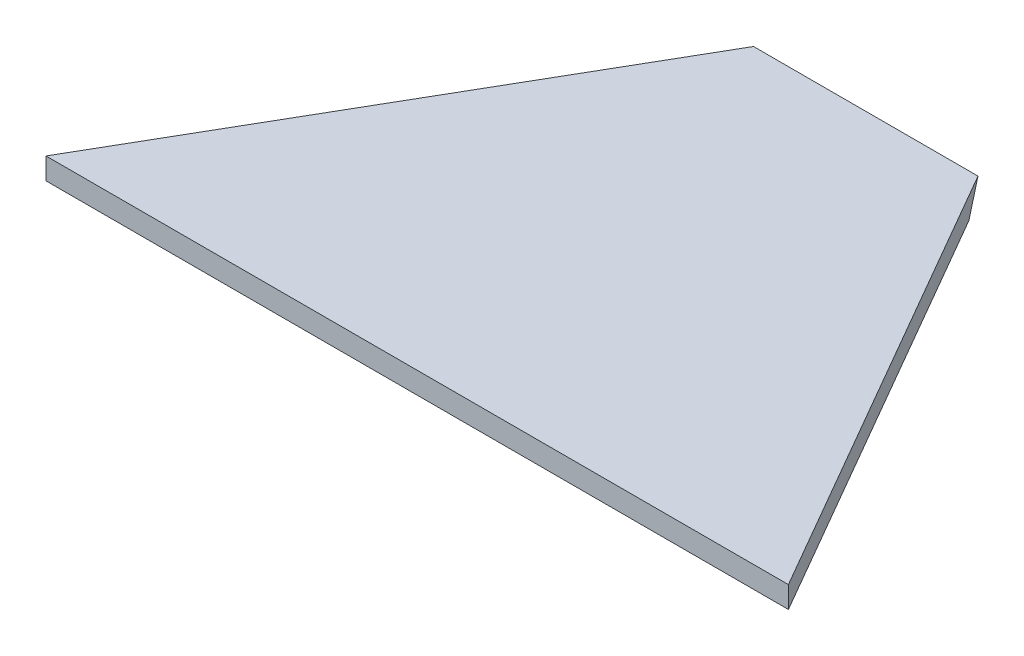
ISO-10303-21;
HEADER;
FILE_DESCRIPTION(('STEP AP214'),'2;1');
FILE_NAME('part.step','',(''),(''),'','','');
FILE_SCHEMA(('AUTOMOTIVE_DESIGN { 1 0 10303 214 1 1 1 1 }'));
ENDSEC;
DATA;
#1=APPLICATION_CONTEXT('core data for automotive mechanical design processes');
#2=APPLICATION_PROTOCOL_DEFINITION('international standard','automotive_design',2000,#1);
#3=PRODUCT_CONTEXT('',#1,'mechanical');
#4=PRODUCT('Part','Part','',(#3));
#5=PRODUCT_RELATED_PRODUCT_CATEGORY('part','',(#4));
#6=PRODUCT_DEFINITION_FORMATION('','',#4);
#7=PRODUCT_DEFINITION_CONTEXT('part definition',#1,'design');
#8=PRODUCT_DEFINITION('design','',#6,#7);
#9=PRODUCT_DEFINITION_SHAPE('','',#8);
#10=(LENGTH_UNIT() NAMED_UNIT(*) SI_UNIT(.MILLI.,.METRE.));
#11=(NAMED_UNIT(*) PLANE_ANGLE_UNIT() SI_UNIT($,.RADIAN.));
#12=(NAMED_UNIT(*) SI_UNIT($,.STERADIAN.) SOLID_ANGLE_UNIT());
#13=UNCERTAINTY_MEASURE_WITH_UNIT(LENGTH_MEASURE(1.E-05),#10,'distance_accuracy_value','');
#14=(GEOMETRIC_REPRESENTATION_CONTEXT(3) GLOBAL_UNCERTAINTY_ASSIGNED_CONTEXT((#13)) GLOBAL_UNIT_ASSIGNED_CONTEXT((#10,
#11,#12)) REPRESENTATION_CONTEXT('',''));
#15=CARTESIAN_POINT('',(0.,0.,0.));
#16=DIRECTION('',(0.,0.,1.));
#17=DIRECTION('',(1.,0.,0.));
#18=AXIS2_PLACEMENT_3D('',#15,#16,#17);
#19=CARTESIAN_POINT('',(-109.22,6.35,85.0861411019661));
#20=DIRECTION('',(-0.86602540378444,0.,-0.499999999999998));
#21=DIRECTION('',(-0.499999999999998,0.,0.86602540378444));
#22=AXIS2_PLACEMENT_3D('',#19,#20,#21);
#23=PLANE('',#22);
#24=DIRECTION('',(0.499999999999998,0.,-0.86602540378444));
#25=VECTOR('',#24,1.);
#26=CARTESIAN_POINT('',(-109.22,6.35,85.0861411019661));
#27=LINE('',#26,#25);
#28=CARTESIAN_POINT('',(-109.22,6.35,85.0861411019661));
#29=VERTEX_POINT('',#28);
#30=CARTESIAN_POINT('',(-33.02,6.35,-46.8961304347825));
#31=VERTEX_POINT('',#30);
#32=EDGE_CURVE('E94',#29,#31,#27,.T.);
#33=ORIENTED_EDGE('',*,*,#32,.T.);
#34=DIRECTION('',(-0.377964473009227,-0.654653670707973,0.654653670707981));
#35=VECTOR('',#34,1.);
#36=CARTESIAN_POINT('',(-43.9058571428571,-12.504857655365,-28.0412727794173));
#37=LINE('',#36,#35);
#38=CARTESIAN_POINT('',(-36.6861742093541,0.,-40.5461304347825));
#39=VERTEX_POINT('',#38);
#40=EDGE_CURVE('E98',#31,#39,#37,.T.);
#41=ORIENTED_EDGE('',*,*,#40,.T.);
#42=DIRECTION('',(0.499999999999998,0.,-0.86602540378444));
#43=VECTOR('',#42,1.);
#44=CARTESIAN_POINT('',(-109.22,0.,85.0861411019661));
#45=LINE('',#44,#43);
#46=CARTESIAN_POINT('',(-109.22,0.,85.0861411019661));
#47=VERTEX_POINT('',#46);
#48=EDGE_CURVE('E90',#47,#39,#45,.T.);
#49=ORIENTED_EDGE('',*,*,#48,.F.);
#50=DIRECTION('',(0.,-1.,0.));
#51=VECTOR('',#50,1.);
#52=CARTESIAN_POINT('',(-109.22,6.35,85.0861411019661));
#53=LINE('',#52,#51);
#54=EDGE_CURVE('E11',#29,#47,#53,.T.);
#55=ORIENTED_EDGE('',*,*,#54,.F.);
#56=EDGE_LOOP('',(#33,#41,#49,#55));
#57=FACE_BOUND('',#56,.T.);
#58=ADVANCED_FACE('F45',(#57),#23,.T.);
#59=CARTESIAN_POINT('',(109.22,6.35,85.0861411019661));
#60=DIRECTION('',(-0.86602540378444,0.,0.499999999999998));
#61=DIRECTION('',(0.499999999999998,0.,0.86602540378444));
#62=AXIS2_PLACEMENT_3D('',#59,#60,#61);
#63=PLANE('',#62);
#64=DIRECTION('',(-0.377964473009227,0.654653670707973,-0.654653670707981));
#65=VECTOR('',#64,1.);
#66=CARTESIAN_POINT('',(43.9058571428571,-12.5048576553649,-28.0412727794174));
#67=LINE('',#66,#65);
#68=CARTESIAN_POINT('',(36.6861742093541,0.,-40.5461304347825));
#69=VERTEX_POINT('',#68);
#70=CARTESIAN_POINT('',(33.02,6.35,-46.8961304347825));
#71=VERTEX_POINT('',#70);
#72=EDGE_CURVE('E60',#69,#71,#67,.T.);
#73=ORIENTED_EDGE('',*,*,#72,.T.);
#74=DIRECTION('',(-0.499999999999998,0.,-0.86602540378444));
#75=VECTOR('',#74,1.);
#76=CARTESIAN_POINT('',(109.22,6.35,85.0861411019661));
#77=LINE('',#76,#75);
#78=CARTESIAN_POINT('',(109.22,6.35,85.0861411019661));
#79=VERTEX_POINT('',#78);
#80=EDGE_CURVE('E109',#79,#71,#77,.T.);
#81=ORIENTED_EDGE('',*,*,#80,.F.);
#82=DIRECTION('',(0.,-1.,0.));
#83=VECTOR('',#82,1.);
#84=CARTESIAN_POINT('',(109.22,6.35,85.0861411019661));
#85=LINE('',#84,#83);
#86=CARTESIAN_POINT('',(109.22,0.,85.0861411019661));
#87=VERTEX_POINT('',#86);
#88=EDGE_CURVE('E48',#79,#87,#85,.T.);
#89=ORIENTED_EDGE('',*,*,#88,.T.);
#90=DIRECTION('',(-0.499999999999998,0.,-0.86602540378444));
#91=VECTOR('',#90,1.);
#92=CARTESIAN_POINT('',(109.22,0.,85.0861411019661));
#93=LINE('',#92,#91);
#94=EDGE_CURVE('E92',#87,#69,#93,.T.);
#95=ORIENTED_EDGE('',*,*,#94,.T.);
#96=EDGE_LOOP('',(#73,#81,#89,#95));
#97=FACE_BOUND('',#96,.T.);
#98=ADVANCED_FACE('F123',(#97),#63,.F.);
#99=CARTESIAN_POINT('',(0.,0.,0.));
#100=DIRECTION('',(0.,-1.,0.));
#101=DIRECTION('',(0.,0.,-1.));
#102=AXIS2_PLACEMENT_3D('',#99,#100,#101);
#103=PLANE('',#102);
#104=ORIENTED_EDGE('',*,*,#48,.T.);
#105=DIRECTION('',(-1.,0.,0.));
#106=VECTOR('',#105,1.);
#107=CARTESIAN_POINT('',(109.221,0.,-40.5461304347825));
#108=LINE('',#107,#106);
#109=EDGE_CURVE('E100',#69,#39,#108,.T.);
#110=ORIENTED_EDGE('',*,*,#109,.F.);
#111=ORIENTED_EDGE('',*,*,#94,.F.);
#112=DIRECTION('',(1.,0.,0.));
#113=VECTOR('',#112,1.);
#114=CARTESIAN_POINT('',(-109.22,0.,85.0861411019661));
#115=LINE('',#114,#113);
#116=EDGE_CURVE('E81',#47,#87,#115,.T.);
#117=ORIENTED_EDGE('',*,*,#116,.F.);
#118=EDGE_LOOP('',(#104,#110,#111,#117));
#119=FACE_BOUND('',#118,.T.);
#120=ADVANCED_FACE('F88',(#119),#103,.T.);
#121=CARTESIAN_POINT('',(-109.22,6.35,85.0861411019661));
#122=DIRECTION('',(0.,0.,-1.));
#123=DIRECTION('',(-1.,0.,0.));
#124=AXIS2_PLACEMENT_3D('',#121,#122,#123);
#125=PLANE('',#124);
#126=ORIENTED_EDGE('',*,*,#116,.T.);
#127=ORIENTED_EDGE('',*,*,#88,.F.);
#128=DIRECTION('',(1.,0.,0.));
#129=VECTOR('',#128,1.);
#130=CARTESIAN_POINT('',(-109.22,6.35,85.0861411019661));
#131=LINE('',#130,#129);
#132=EDGE_CURVE('E83',#29,#79,#131,.T.);
#133=ORIENTED_EDGE('',*,*,#132,.F.);
#134=ORIENTED_EDGE('',*,*,#54,.T.);
#135=EDGE_LOOP('',(#126,#127,#133,#134));
#136=FACE_BOUND('',#135,.T.);
#137=ADVANCED_FACE('F79',(#136),#125,.F.);
#138=CARTESIAN_POINT('',(0.,6.35,0.));
#139=DIRECTION('',(0.,-1.,0.));
#140=DIRECTION('',(0.,0.,-1.));
#141=AXIS2_PLACEMENT_3D('',#138,#139,#140);
#142=PLANE('',#141);
#143=ORIENTED_EDGE('',*,*,#32,.F.);
#144=ORIENTED_EDGE('',*,*,#132,.T.);
#145=ORIENTED_EDGE('',*,*,#80,.T.);
#146=DIRECTION('',(1.,0.,0.));
#147=VECTOR('',#146,1.);
#148=CARTESIAN_POINT('',(-33.02,6.35,-46.8961304347825));
#149=LINE('',#148,#147);
#150=EDGE_CURVE('E113',#31,#71,#149,.T.);
#151=ORIENTED_EDGE('',*,*,#150,.F.);
#152=EDGE_LOOP('',(#143,#144,#145,#151));
#153=FACE_BOUND('',#152,.T.);
#154=ADVANCED_FACE('F126',(#153),#142,.F.);
#155=CARTESIAN_POINT('',(109.221,6.35,-46.8961304347825));
#156=DIRECTION('',(0.,-0.707106781186552,-0.707106781186543));
#157=DIRECTION('',(0.,0.707106781186543,-0.707106781186552));
#158=AXIS2_PLACEMENT_3D('',#155,#156,#157);
#159=PLANE('',#158);
#160=ORIENTED_EDGE('',*,*,#109,.T.);
#161=ORIENTED_EDGE('',*,*,#40,.F.);
#162=ORIENTED_EDGE('',*,*,#150,.T.);
#163=ORIENTED_EDGE('',*,*,#72,.F.);
#164=EDGE_LOOP('',(#160,#161,#162,#163));
#165=FACE_BOUND('',#164,.T.);
#166=ADVANCED_FACE('F131',(#165),#159,.T.);
#167=CLOSED_SHELL('',(#58,#98,#120,#137,#154,#166));
#168=MANIFOLD_SOLID_BREP('B2',#167);
#169=ADVANCED_BREP_SHAPE_REPRESENTATION('',(#18,#168),#14);
#170=SHAPE_DEFINITION_REPRESENTATION(#9,#169);
ENDSEC;
END-ISO-10303-21;
